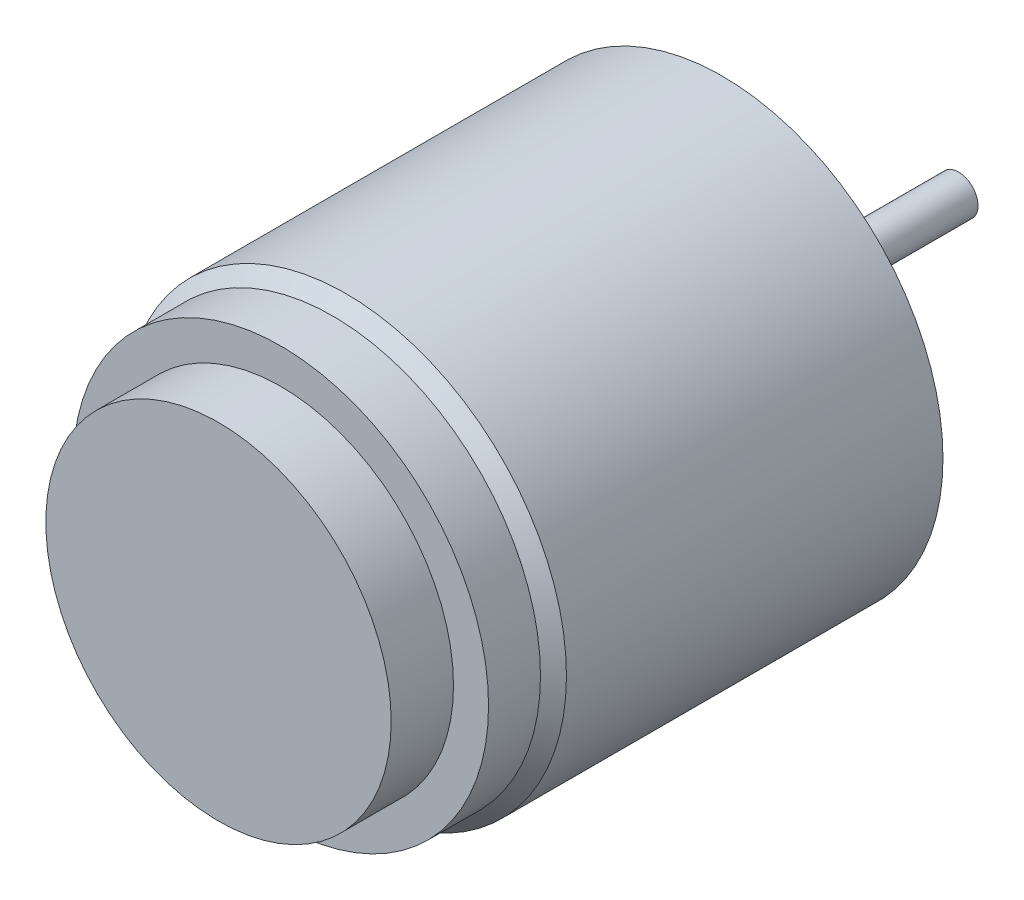
ISO-10303-21;
HEADER;
FILE_DESCRIPTION(('STEP AP214'),'2;1');
FILE_NAME('part.step','',(''),(''),'','','');
FILE_SCHEMA(('AUTOMOTIVE_DESIGN { 1 0 10303 214 1 1 1 1 }'));
ENDSEC;
DATA;
#1=APPLICATION_CONTEXT('core data for automotive mechanical design processes');
#2=APPLICATION_PROTOCOL_DEFINITION('international standard','automotive_design',2000,#1);
#3=PRODUCT_CONTEXT('',#1,'mechanical');
#4=PRODUCT('Part','Part','',(#3));
#5=PRODUCT_RELATED_PRODUCT_CATEGORY('part','',(#4));
#6=PRODUCT_DEFINITION_FORMATION('','',#4);
#7=PRODUCT_DEFINITION_CONTEXT('part definition',#1,'design');
#8=PRODUCT_DEFINITION('design','',#6,#7);
#9=PRODUCT_DEFINITION_SHAPE('','',#8);
#10=(LENGTH_UNIT() NAMED_UNIT(*) SI_UNIT(.MILLI.,.METRE.));
#11=(NAMED_UNIT(*) PLANE_ANGLE_UNIT() SI_UNIT($,.RADIAN.));
#12=(NAMED_UNIT(*) SI_UNIT($,.STERADIAN.) SOLID_ANGLE_UNIT());
#13=UNCERTAINTY_MEASURE_WITH_UNIT(LENGTH_MEASURE(1.E-05),#10,'distance_accuracy_value','');
#14=(GEOMETRIC_REPRESENTATION_CONTEXT(3) GLOBAL_UNCERTAINTY_ASSIGNED_CONTEXT((#13)) GLOBAL_UNIT_ASSIGNED_CONTEXT((#10,
#11,#12)) REPRESENTATION_CONTEXT('',''));
#15=CARTESIAN_POINT('',(0.,0.,0.));
#16=DIRECTION('',(0.,0.,1.));
#17=DIRECTION('',(1.,0.,0.));
#18=AXIS2_PLACEMENT_3D('',#15,#16,#17);
#19=CARTESIAN_POINT('',(0.,0.,-3.1));
#20=DIRECTION('',(0.,0.,-1.));
#21=DIRECTION('',(-1.,0.,0.));
#22=AXIS2_PLACEMENT_3D('',#19,#20,#21);
#23=PLANE('',#22);
#24=CARTESIAN_POINT('',(0.,0.,-3.1));
#25=DIRECTION('',(0.,0.,-1.));
#26=DIRECTION('',(-1.,0.,0.));
#27=AXIS2_PLACEMENT_3D('',#24,#25,#26);
#28=CIRCLE('',#27,1.75);
#29=CARTESIAN_POINT('',(-1.75,0.,-3.1));
#30=VERTEX_POINT('',#29);
#31=EDGE_CURVE('E102',#30,#30,#28,.T.);
#32=ORIENTED_EDGE('',*,*,#31,.T.);
#33=EDGE_LOOP('',(#32));
#34=FACE_BOUND('',#33,.T.);
#35=CARTESIAN_POINT('',(0.,0.,-3.1));
#36=DIRECTION('',(0.,0.,-1.));
#37=DIRECTION('',(-1.,0.,0.));
#38=AXIS2_PLACEMENT_3D('',#35,#36,#37);
#39=CIRCLE('',#38,0.75);
#40=CARTESIAN_POINT('',(-0.75,0.,-3.1));
#41=VERTEX_POINT('',#40);
#42=EDGE_CURVE('E109',#41,#41,#39,.T.);
#43=ORIENTED_EDGE('',*,*,#42,.F.);
#44=EDGE_LOOP('',(#43));
#45=FACE_BOUND('',#44,.T.);
#46=ADVANCED_FACE('F34',(#34,#45),#23,.T.);
#47=CARTESIAN_POINT('',(0.,0.,-1.));
#48=DIRECTION('',(0.,0.,-1.));
#49=DIRECTION('',(-1.,0.,0.));
#50=AXIS2_PLACEMENT_3D('',#47,#48,#49);
#51=PLANE('',#50);
#52=CARTESIAN_POINT('',(0.,0.,-1.));
#53=DIRECTION('',(0.,0.,-1.));
#54=DIRECTION('',(-1.,0.,0.));
#55=AXIS2_PLACEMENT_3D('',#52,#53,#54);
#56=CIRCLE('',#55,3.);
#57=CARTESIAN_POINT('',(-3.,0.,-1.));
#58=VERTEX_POINT('',#57);
#59=EDGE_CURVE('E97',#58,#58,#56,.T.);
#60=ORIENTED_EDGE('',*,*,#59,.T.);
#61=EDGE_LOOP('',(#60));
#62=FACE_BOUND('',#61,.T.);
#63=CARTESIAN_POINT('',(0.,0.,-1.));
#64=DIRECTION('',(0.,0.,-1.));
#65=DIRECTION('',(-1.,0.,0.));
#66=AXIS2_PLACEMENT_3D('',#63,#64,#65);
#67=CIRCLE('',#66,1.75);
#68=CARTESIAN_POINT('',(-1.75,0.,-1.));
#69=VERTEX_POINT('',#68);
#70=EDGE_CURVE('E103',#69,#69,#67,.T.);
#71=ORIENTED_EDGE('',*,*,#70,.F.);
#72=EDGE_LOOP('',(#71));
#73=FACE_BOUND('',#72,.T.);
#74=ADVANCED_FACE('F125',(#62,#73),#51,.T.);
#75=CARTESIAN_POINT('',(0.,0.,0.));
#76=DIRECTION('',(0.,0.,1.));
#77=DIRECTION('',(1.,0.,0.));
#78=AXIS2_PLACEMENT_3D('',#75,#76,#77);
#79=PLANE('',#78);
#80=CARTESIAN_POINT('',(0.,0.,0.));
#81=DIRECTION('',(0.,0.,1.));
#82=DIRECTION('',(1.,0.,0.));
#83=AXIS2_PLACEMENT_3D('',#80,#81,#82);
#84=CIRCLE('',#83,8.5);
#85=CARTESIAN_POINT('',(8.5,0.,0.));
#86=VERTEX_POINT('',#85);
#87=EDGE_CURVE('E49',#86,#86,#84,.T.);
#88=ORIENTED_EDGE('',*,*,#87,.F.);
#89=EDGE_LOOP('',(#88));
#90=FACE_BOUND('',#89,.T.);
#91=CARTESIAN_POINT('',(4.33012701892212,2.49999999999987,0.));
#92=DIRECTION('',(0.,0.,-1.));
#93=DIRECTION('',(-1.,0.,0.));
#94=AXIS2_PLACEMENT_3D('',#91,#92,#93);
#95=CIRCLE('',#94,0.800000000000164);
#96=CARTESIAN_POINT('',(3.53012701892196,2.49999999999987,0.));
#97=VERTEX_POINT('',#96);
#98=EDGE_CURVE('E64',#97,#97,#95,.T.);
#99=ORIENTED_EDGE('',*,*,#98,.F.);
#100=EDGE_LOOP('',(#99));
#101=FACE_BOUND('',#100,.T.);
#102=CARTESIAN_POINT('',(0.,5.,0.));
#103=DIRECTION('',(0.,0.,-1.));
#104=DIRECTION('',(-1.,0.,0.));
#105=AXIS2_PLACEMENT_3D('',#102,#103,#104);
#106=CIRCLE('',#105,0.8);
#107=CARTESIAN_POINT('',(-0.8,5.,0.));
#108=VERTEX_POINT('',#107);
#109=EDGE_CURVE('E67',#108,#108,#106,.T.);
#110=ORIENTED_EDGE('',*,*,#109,.F.);
#111=EDGE_LOOP('',(#110));
#112=FACE_BOUND('',#111,.T.);
#113=CARTESIAN_POINT('',(-4.33012701892226,2.50000000000012,0.));
#114=DIRECTION('',(0.,0.,-1.));
#115=DIRECTION('',(-1.,0.,0.));
#116=AXIS2_PLACEMENT_3D('',#113,#114,#115);
#117=CIRCLE('',#116,0.800000000000044);
#118=CARTESIAN_POINT('',(-5.13012701892231,2.50000000000012,0.));
#119=VERTEX_POINT('',#118);
#120=EDGE_CURVE('E73',#119,#119,#117,.T.);
#121=ORIENTED_EDGE('',*,*,#120,.F.);
#122=EDGE_LOOP('',(#121));
#123=FACE_BOUND('',#122,.T.);
#124=CARTESIAN_POINT('',(-4.33012701892241,-2.49999999999988,0.));
#125=DIRECTION('',(0.,0.,-1.));
#126=DIRECTION('',(-1.,0.,0.));
#127=AXIS2_PLACEMENT_3D('',#124,#125,#126);
#128=CIRCLE('',#127,0.80000000000019);
#129=CARTESIAN_POINT('',(-5.1301270189226,-2.49999999999988,0.));
#130=VERTEX_POINT('',#129);
#131=EDGE_CURVE('E79',#130,#130,#128,.T.);
#132=ORIENTED_EDGE('',*,*,#131,.F.);
#133=EDGE_LOOP('',(#132));
#134=FACE_BOUND('',#133,.T.);
#135=CARTESIAN_POINT('',(-2.82992447504893E-13,-5.,0.));
#136=DIRECTION('',(0.,0.,-1.));
#137=DIRECTION('',(-1.,0.,0.));
#138=AXIS2_PLACEMENT_3D('',#135,#136,#137);
#139=CIRCLE('',#138,0.800000000000304);
#140=CARTESIAN_POINT('',(-0.800000000000587,-5.,0.));
#141=VERTEX_POINT('',#140);
#142=EDGE_CURVE('E85',#141,#141,#139,.T.);
#143=ORIENTED_EDGE('',*,*,#142,.F.);
#144=EDGE_LOOP('',(#143));
#145=FACE_BOUND('',#144,.T.);
#146=CARTESIAN_POINT('',(4.33012701892198,-2.50000000000012,0.));
#147=DIRECTION('',(0.,0.,-1.));
#148=DIRECTION('',(-1.,0.,0.));
#149=AXIS2_PLACEMENT_3D('',#146,#147,#148);
#150=CIRCLE('',#149,0.800000000000283);
#151=CARTESIAN_POINT('',(3.5301270189217,-2.50000000000012,0.));
#152=VERTEX_POINT('',#151);
#153=EDGE_CURVE('E91',#152,#152,#150,.T.);
#154=ORIENTED_EDGE('',*,*,#153,.F.);
#155=EDGE_LOOP('',(#154));
#156=FACE_BOUND('',#155,.T.);
#157=CARTESIAN_POINT('',(0.,0.,0.));
#158=DIRECTION('',(0.,0.,1.));
#159=DIRECTION('',(1.,0.,0.));
#160=AXIS2_PLACEMENT_3D('',#157,#158,#159);
#161=CIRCLE('',#160,3.);
#162=CARTESIAN_POINT('',(3.,0.,0.));
#163=VERTEX_POINT('',#162);
#164=EDGE_CURVE('E10',#163,#163,#161,.F.);
#165=ORIENTED_EDGE('',*,*,#164,.F.);
#166=EDGE_LOOP('',(#165));
#167=FACE_BOUND('',#166,.T.);
#168=ADVANCED_FACE('F131',(#90,#101,#112,#123,#134,#145,#156,#167),#79,.F.);
#169=CARTESIAN_POINT('',(0.,0.,17.));
#170=DIRECTION('',(0.,0.,1.));
#171=DIRECTION('',(1.,0.,0.));
#172=AXIS2_PLACEMENT_3D('',#169,#170,#171);
#173=PLANE('',#172);
#174=CARTESIAN_POINT('',(0.,0.,17.));
#175=DIRECTION('',(0.,0.,1.));
#176=DIRECTION('',(1.,0.,0.));
#177=AXIS2_PLACEMENT_3D('',#174,#175,#176);
#178=CIRCLE('',#177,8.);
#179=CARTESIAN_POINT('',(8.,0.,17.));
#180=VERTEX_POINT('',#179);
#181=EDGE_CURVE('E54',#180,#180,#178,.T.);
#182=ORIENTED_EDGE('',*,*,#181,.T.);
#183=EDGE_LOOP('',(#182));
#184=FACE_BOUND('',#183,.T.);
#185=CARTESIAN_POINT('',(0.,0.,17.));
#186=DIRECTION('',(0.,0.,1.));
#187=DIRECTION('',(1.,0.,0.));
#188=AXIS2_PLACEMENT_3D('',#185,#186,#187);
#189=CIRCLE('',#188,6.65);
#190=CARTESIAN_POINT('',(6.65,0.,17.));
#191=VERTEX_POINT('',#190);
#192=EDGE_CURVE('E58',#191,#191,#189,.T.);
#193=ORIENTED_EDGE('',*,*,#192,.F.);
#194=EDGE_LOOP('',(#193));
#195=FACE_BOUND('',#194,.T.);
#196=ADVANCED_FACE('F200',(#184,#195),#173,.T.);
#197=CARTESIAN_POINT('',(0.,0.,15.));
#198=DIRECTION('',(0.,0.,-1.));
#199=DIRECTION('',(-1.,0.,0.));
#200=AXIS2_PLACEMENT_3D('',#197,#198,#199);
#201=CYLINDRICAL_SURFACE('',#200,8.5);
#202=CARTESIAN_POINT('',(0.,0.,14.5));
#203=DIRECTION('',(0.,0.,1.));
#204=DIRECTION('',(1.,0.,0.));
#205=AXIS2_PLACEMENT_3D('',#202,#203,#204);
#206=CIRCLE('',#205,8.5);
#207=CARTESIAN_POINT('',(8.5,0.,14.5));
#208=VERTEX_POINT('',#207);
#209=EDGE_CURVE('E41',#208,#208,#206,.F.);
#210=ORIENTED_EDGE('',*,*,#209,.T.);
#211=EDGE_LOOP('',(#210));
#212=FACE_BOUND('',#211,.T.);
#213=ORIENTED_EDGE('',*,*,#87,.T.);
#214=EDGE_LOOP('',(#213));
#215=FACE_BOUND('',#214,.T.);
#216=ADVANCED_FACE('F203',(#212,#215),#201,.T.);
#217=CARTESIAN_POINT('',(0.,0.,15.));
#218=DIRECTION('',(0.,0.,-1.));
#219=DIRECTION('',(-1.,0.,0.));
#220=AXIS2_PLACEMENT_3D('',#217,#218,#219);
#221=CONICAL_SURFACE('',#220,8.00000000000001,0.785398163397447);
#222=ORIENTED_EDGE('',*,*,#209,.F.);
#223=EDGE_LOOP('',(#222));
#224=FACE_BOUND('',#223,.T.);
#225=CARTESIAN_POINT('',(0.,0.,15.));
#226=DIRECTION('',(0.,0.,1.));
#227=DIRECTION('',(1.,0.,0.));
#228=AXIS2_PLACEMENT_3D('',#225,#226,#227);
#229=CIRCLE('',#228,8.00000000000001);
#230=CARTESIAN_POINT('',(8.00000000000001,0.,15.));
#231=VERTEX_POINT('',#230);
#232=EDGE_CURVE('E45',#231,#231,#229,.T.);
#233=ORIENTED_EDGE('',*,*,#232,.F.);
#234=EDGE_LOOP('',(#233));
#235=FACE_BOUND('',#234,.T.);
#236=ADVANCED_FACE('F36',(#224,#235),#221,.T.);
#237=CARTESIAN_POINT('',(0.,0.,17.));
#238=DIRECTION('',(0.,0.,-1.));
#239=DIRECTION('',(-1.,0.,0.));
#240=AXIS2_PLACEMENT_3D('',#237,#238,#239);
#241=CYLINDRICAL_SURFACE('',#240,8.);
#242=ORIENTED_EDGE('',*,*,#181,.F.);
#243=EDGE_LOOP('',(#242));
#244=FACE_BOUND('',#243,.T.);
#245=ORIENTED_EDGE('',*,*,#232,.T.);
#246=EDGE_LOOP('',(#245));
#247=FACE_BOUND('',#246,.T.);
#248=ADVANCED_FACE('F198',(#244,#247),#241,.T.);
#249=CARTESIAN_POINT('',(0.,0.,19.4));
#250=DIRECTION('',(0.,0.,-1.));
#251=DIRECTION('',(-1.,0.,0.));
#252=AXIS2_PLACEMENT_3D('',#249,#250,#251);
#253=CYLINDRICAL_SURFACE('',#252,6.65);
#254=CARTESIAN_POINT('',(0.,0.,19.4));
#255=DIRECTION('',(0.,0.,1.));
#256=DIRECTION('',(1.,0.,0.));
#257=AXIS2_PLACEMENT_3D('',#254,#255,#256);
#258=CIRCLE('',#257,6.65);
#259=CARTESIAN_POINT('',(6.65,0.,19.4));
#260=VERTEX_POINT('',#259);
#261=EDGE_CURVE('E57',#260,#260,#258,.T.);
#262=ORIENTED_EDGE('',*,*,#261,.F.);
#263=EDGE_LOOP('',(#262));
#264=FACE_BOUND('',#263,.T.);
#265=ORIENTED_EDGE('',*,*,#192,.T.);
#266=EDGE_LOOP('',(#265));
#267=FACE_BOUND('',#266,.T.);
#268=ADVANCED_FACE('F194',(#264,#267),#253,.T.);
#269=CARTESIAN_POINT('',(0.,0.,19.4));
#270=DIRECTION('',(0.,0.,1.));
#271=DIRECTION('',(1.,0.,0.));
#272=AXIS2_PLACEMENT_3D('',#269,#270,#271);
#273=PLANE('',#272);
#274=ORIENTED_EDGE('',*,*,#261,.T.);
#275=EDGE_LOOP('',(#274));
#276=FACE_BOUND('',#275,.T.);
#277=ADVANCED_FACE('F190',(#276),#273,.T.);
#278=CARTESIAN_POINT('',(4.33012701892212,2.49999999999987,1.6));
#279=DIRECTION('',(0.,0.,-1.));
#280=DIRECTION('',(-1.,0.,0.));
#281=AXIS2_PLACEMENT_3D('',#278,#279,#280);
#282=CYLINDRICAL_SURFACE('',#281,0.800000000000164);
#283=CARTESIAN_POINT('',(4.33012701892212,2.49999999999987,1.6));
#284=DIRECTION('',(0.,0.,-1.));
#285=DIRECTION('',(-1.,0.,0.));
#286=AXIS2_PLACEMENT_3D('',#283,#284,#285);
#287=CIRCLE('',#286,0.800000000000164);
#288=CARTESIAN_POINT('',(3.53012701892196,2.49999999999987,1.6));
#289=VERTEX_POINT('',#288);
#290=EDGE_CURVE('E61',#289,#289,#287,.T.);
#291=ORIENTED_EDGE('',*,*,#290,.F.);
#292=EDGE_LOOP('',(#291));
#293=FACE_BOUND('',#292,.T.);
#294=ORIENTED_EDGE('',*,*,#98,.T.);
#295=EDGE_LOOP('',(#294));
#296=FACE_BOUND('',#295,.T.);
#297=ADVANCED_FACE('F186',(#293,#296),#282,.F.);
#298=CARTESIAN_POINT('',(4.33012701892212,2.49999999999987,1.6));
#299=DIRECTION('',(0.,0.,-1.));
#300=DIRECTION('',(-1.,0.,0.));
#301=AXIS2_PLACEMENT_3D('',#298,#299,#300);
#302=PLANE('',#301);
#303=ORIENTED_EDGE('',*,*,#290,.T.);
#304=EDGE_LOOP('',(#303));
#305=FACE_BOUND('',#304,.T.);
#306=ADVANCED_FACE('F179',(#305),#302,.T.);
#307=CARTESIAN_POINT('',(0.,5.,1.6));
#308=DIRECTION('',(0.,0.,-1.));
#309=DIRECTION('',(-1.,0.,0.));
#310=AXIS2_PLACEMENT_3D('',#307,#308,#309);
#311=CYLINDRICAL_SURFACE('',#310,0.8);
#312=CARTESIAN_POINT('',(0.,5.,1.6));
#313=DIRECTION('',(0.,0.,-1.));
#314=DIRECTION('',(-1.,0.,0.));
#315=AXIS2_PLACEMENT_3D('',#312,#313,#314);
#316=CIRCLE('',#315,0.8);
#317=CARTESIAN_POINT('',(-0.8,5.,1.6));
#318=VERTEX_POINT('',#317);
#319=EDGE_CURVE('E70',#318,#318,#316,.T.);
#320=ORIENTED_EDGE('',*,*,#319,.F.);
#321=EDGE_LOOP('',(#320));
#322=FACE_BOUND('',#321,.T.);
#323=ORIENTED_EDGE('',*,*,#109,.T.);
#324=EDGE_LOOP('',(#323));
#325=FACE_BOUND('',#324,.T.);
#326=ADVANCED_FACE('F176',(#322,#325),#311,.F.);
#327=CARTESIAN_POINT('',(0.,5.,1.6));
#328=DIRECTION('',(0.,0.,-1.));
#329=DIRECTION('',(-1.,0.,0.));
#330=AXIS2_PLACEMENT_3D('',#327,#328,#329);
#331=PLANE('',#330);
#332=ORIENTED_EDGE('',*,*,#319,.T.);
#333=EDGE_LOOP('',(#332));
#334=FACE_BOUND('',#333,.T.);
#335=ADVANCED_FACE('F171',(#334),#331,.T.);
#336=CARTESIAN_POINT('',(-4.33012701892226,2.50000000000012,1.6));
#337=DIRECTION('',(0.,0.,-1.));
#338=DIRECTION('',(-1.,0.,0.));
#339=AXIS2_PLACEMENT_3D('',#336,#337,#338);
#340=CYLINDRICAL_SURFACE('',#339,0.800000000000044);
#341=CARTESIAN_POINT('',(-4.33012701892226,2.50000000000012,1.6));
#342=DIRECTION('',(0.,0.,-1.));
#343=DIRECTION('',(-1.,0.,0.));
#344=AXIS2_PLACEMENT_3D('',#341,#342,#343);
#345=CIRCLE('',#344,0.800000000000044);
#346=CARTESIAN_POINT('',(-5.13012701892231,2.50000000000012,1.6));
#347=VERTEX_POINT('',#346);
#348=EDGE_CURVE('E76',#347,#347,#345,.T.);
#349=ORIENTED_EDGE('',*,*,#348,.F.);
#350=EDGE_LOOP('',(#349));
#351=FACE_BOUND('',#350,.T.);
#352=ORIENTED_EDGE('',*,*,#120,.T.);
#353=EDGE_LOOP('',(#352));
#354=FACE_BOUND('',#353,.T.);
#355=ADVANCED_FACE('F168',(#351,#354),#340,.F.);
#356=CARTESIAN_POINT('',(-4.33012701892226,2.50000000000012,1.6));
#357=DIRECTION('',(0.,0.,-1.));
#358=DIRECTION('',(-1.,0.,0.));
#359=AXIS2_PLACEMENT_3D('',#356,#357,#358);
#360=PLANE('',#359);
#361=ORIENTED_EDGE('',*,*,#348,.T.);
#362=EDGE_LOOP('',(#361));
#363=FACE_BOUND('',#362,.T.);
#364=ADVANCED_FACE('F163',(#363),#360,.T.);
#365=CARTESIAN_POINT('',(-4.33012701892241,-2.49999999999988,1.6));
#366=DIRECTION('',(0.,0.,-1.));
#367=DIRECTION('',(-1.,0.,0.));
#368=AXIS2_PLACEMENT_3D('',#365,#366,#367);
#369=CYLINDRICAL_SURFACE('',#368,0.80000000000019);
#370=CARTESIAN_POINT('',(-4.33012701892241,-2.49999999999988,1.6));
#371=DIRECTION('',(0.,0.,-1.));
#372=DIRECTION('',(-1.,0.,0.));
#373=AXIS2_PLACEMENT_3D('',#370,#371,#372);
#374=CIRCLE('',#373,0.80000000000019);
#375=CARTESIAN_POINT('',(-5.1301270189226,-2.49999999999988,1.6));
#376=VERTEX_POINT('',#375);
#377=EDGE_CURVE('E82',#376,#376,#374,.T.);
#378=ORIENTED_EDGE('',*,*,#377,.F.);
#379=EDGE_LOOP('',(#378));
#380=FACE_BOUND('',#379,.T.);
#381=ORIENTED_EDGE('',*,*,#131,.T.);
#382=EDGE_LOOP('',(#381));
#383=FACE_BOUND('',#382,.T.);
#384=ADVANCED_FACE('F160',(#380,#383),#369,.F.);
#385=CARTESIAN_POINT('',(-4.33012701892241,-2.49999999999988,1.6));
#386=DIRECTION('',(0.,0.,-1.));
#387=DIRECTION('',(-1.,0.,0.));
#388=AXIS2_PLACEMENT_3D('',#385,#386,#387);
#389=PLANE('',#388);
#390=ORIENTED_EDGE('',*,*,#377,.T.);
#391=EDGE_LOOP('',(#390));
#392=FACE_BOUND('',#391,.T.);
#393=ADVANCED_FACE('F155',(#392),#389,.T.);
#394=CARTESIAN_POINT('',(-2.82992447504893E-13,-5.,1.6));
#395=DIRECTION('',(0.,0.,-1.));
#396=DIRECTION('',(-1.,0.,0.));
#397=AXIS2_PLACEMENT_3D('',#394,#395,#396);
#398=CYLINDRICAL_SURFACE('',#397,0.800000000000304);
#399=CARTESIAN_POINT('',(-2.82992447504893E-13,-5.,1.6));
#400=DIRECTION('',(0.,0.,-1.));
#401=DIRECTION('',(-1.,0.,0.));
#402=AXIS2_PLACEMENT_3D('',#399,#400,#401);
#403=CIRCLE('',#402,0.800000000000304);
#404=CARTESIAN_POINT('',(-0.800000000000587,-5.,1.6));
#405=VERTEX_POINT('',#404);
#406=EDGE_CURVE('E88',#405,#405,#403,.T.);
#407=ORIENTED_EDGE('',*,*,#406,.F.);
#408=EDGE_LOOP('',(#407));
#409=FACE_BOUND('',#408,.T.);
#410=ORIENTED_EDGE('',*,*,#142,.T.);
#411=EDGE_LOOP('',(#410));
#412=FACE_BOUND('',#411,.T.);
#413=ADVANCED_FACE('F152',(#409,#412),#398,.F.);
#414=CARTESIAN_POINT('',(-2.82992447504893E-13,-5.,1.6));
#415=DIRECTION('',(0.,0.,-1.));
#416=DIRECTION('',(-1.,0.,0.));
#417=AXIS2_PLACEMENT_3D('',#414,#415,#416);
#418=PLANE('',#417);
#419=ORIENTED_EDGE('',*,*,#406,.T.);
#420=EDGE_LOOP('',(#419));
#421=FACE_BOUND('',#420,.T.);
#422=ADVANCED_FACE('F147',(#421),#418,.T.);
#423=CARTESIAN_POINT('',(4.33012701892198,-2.50000000000012,1.6));
#424=DIRECTION('',(0.,0.,-1.));
#425=DIRECTION('',(-1.,0.,0.));
#426=AXIS2_PLACEMENT_3D('',#423,#424,#425);
#427=CYLINDRICAL_SURFACE('',#426,0.800000000000283);
#428=CARTESIAN_POINT('',(4.33012701892198,-2.50000000000012,1.6));
#429=DIRECTION('',(0.,0.,-1.));
#430=DIRECTION('',(-1.,0.,0.));
#431=AXIS2_PLACEMENT_3D('',#428,#429,#430);
#432=CIRCLE('',#431,0.800000000000283);
#433=CARTESIAN_POINT('',(3.5301270189217,-2.50000000000012,1.6));
#434=VERTEX_POINT('',#433);
#435=EDGE_CURVE('E94',#434,#434,#432,.T.);
#436=ORIENTED_EDGE('',*,*,#435,.F.);
#437=EDGE_LOOP('',(#436));
#438=FACE_BOUND('',#437,.T.);
#439=ORIENTED_EDGE('',*,*,#153,.T.);
#440=EDGE_LOOP('',(#439));
#441=FACE_BOUND('',#440,.T.);
#442=ADVANCED_FACE('F144',(#438,#441),#427,.F.);
#443=CARTESIAN_POINT('',(4.33012701892198,-2.50000000000012,1.6));
#444=DIRECTION('',(0.,0.,-1.));
#445=DIRECTION('',(-1.,0.,0.));
#446=AXIS2_PLACEMENT_3D('',#443,#444,#445);
#447=PLANE('',#446);
#448=ORIENTED_EDGE('',*,*,#435,.T.);
#449=EDGE_LOOP('',(#448));
#450=FACE_BOUND('',#449,.T.);
#451=ADVANCED_FACE('F142',(#450),#447,.T.);
#452=CARTESIAN_POINT('',(0.,0.,-1.));
#453=DIRECTION('',(0.,0.,1.));
#454=DIRECTION('',(1.,0.,0.));
#455=AXIS2_PLACEMENT_3D('',#452,#453,#454);
#456=CYLINDRICAL_SURFACE('',#455,3.);
#457=ORIENTED_EDGE('',*,*,#59,.F.);
#458=EDGE_LOOP('',(#457));
#459=FACE_BOUND('',#458,.T.);
#460=ORIENTED_EDGE('',*,*,#164,.T.);
#461=EDGE_LOOP('',(#460));
#462=FACE_BOUND('',#461,.T.);
#463=ADVANCED_FACE('F137',(#459,#462),#456,.T.);
#464=CARTESIAN_POINT('',(0.,0.,-3.1));
#465=DIRECTION('',(0.,0.,1.));
#466=DIRECTION('',(1.,0.,0.));
#467=AXIS2_PLACEMENT_3D('',#464,#465,#466);
#468=CYLINDRICAL_SURFACE('',#467,1.75);
#469=ORIENTED_EDGE('',*,*,#31,.F.);
#470=EDGE_LOOP('',(#469));
#471=FACE_BOUND('',#470,.T.);
#472=ORIENTED_EDGE('',*,*,#70,.T.);
#473=EDGE_LOOP('',(#472));
#474=FACE_BOUND('',#473,.T.);
#475=ADVANCED_FACE('F120',(#471,#474),#468,.T.);
#476=CARTESIAN_POINT('',(0.,0.,-9.1));
#477=DIRECTION('',(0.,0.,1.));
#478=DIRECTION('',(1.,0.,0.));
#479=AXIS2_PLACEMENT_3D('',#476,#477,#478);
#480=CYLINDRICAL_SURFACE('',#479,0.75);
#481=CARTESIAN_POINT('',(0.,0.,-9.1));
#482=DIRECTION('',(0.,0.,-1.));
#483=DIRECTION('',(-1.,0.,0.));
#484=AXIS2_PLACEMENT_3D('',#481,#482,#483);
#485=CIRCLE('',#484,0.75);
#486=CARTESIAN_POINT('',(-0.75,0.,-9.1));
#487=VERTEX_POINT('',#486);
#488=EDGE_CURVE('E106',#487,#487,#485,.T.);
#489=ORIENTED_EDGE('',*,*,#488,.F.);
#490=EDGE_LOOP('',(#489));
#491=FACE_BOUND('',#490,.T.);
#492=ORIENTED_EDGE('',*,*,#42,.T.);
#493=EDGE_LOOP('',(#492));
#494=FACE_BOUND('',#493,.T.);
#495=ADVANCED_FACE('F117',(#491,#494),#480,.T.);
#496=CARTESIAN_POINT('',(0.,0.,-9.1));
#497=DIRECTION('',(0.,0.,-1.));
#498=DIRECTION('',(-1.,0.,0.));
#499=AXIS2_PLACEMENT_3D('',#496,#497,#498);
#500=PLANE('',#499);
#501=ORIENTED_EDGE('',*,*,#488,.T.);
#502=EDGE_LOOP('',(#501));
#503=FACE_BOUND('',#502,.T.);
#504=ADVANCED_FACE('F115',(#503),#500,.T.);
#505=CLOSED_SHELL('',(#46,#74,#168,#196,#216,#236,#248,#268,#277,#297,#306,#326,#335,#355,#364,
#384,#393,#413,#422,#442,#451,#463,#475,#495,#504));
#506=MANIFOLD_SOLID_BREP('B2',#505);
#507=ADVANCED_BREP_SHAPE_REPRESENTATION('',(#18,#506),#14);
#508=SHAPE_DEFINITION_REPRESENTATION(#9,#507);
ENDSEC;
END-ISO-10303-21;
